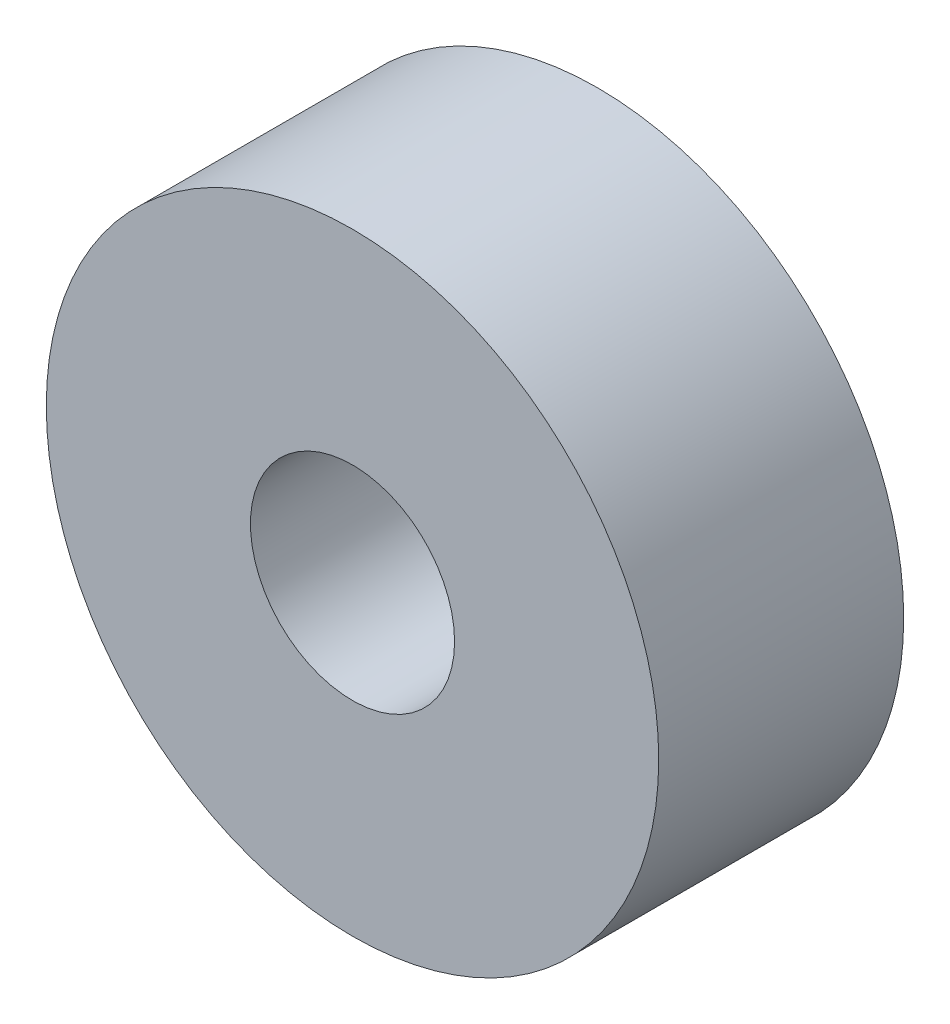
ISO-10303-21;
HEADER;
FILE_DESCRIPTION(('STEP AP214'),'2;1');
FILE_NAME('part.step','',(''),(''),'','','');
FILE_SCHEMA(('AUTOMOTIVE_DESIGN { 1 0 10303 214 1 1 1 1 }'));
ENDSEC;
DATA;
#1=APPLICATION_CONTEXT('core data for automotive mechanical design processes');
#2=APPLICATION_PROTOCOL_DEFINITION('international standard','automotive_design',2000,#1);
#3=PRODUCT_CONTEXT('',#1,'mechanical');
#4=PRODUCT('Part','Part','',(#3));
#5=PRODUCT_RELATED_PRODUCT_CATEGORY('part','',(#4));
#6=PRODUCT_DEFINITION_FORMATION('','',#4);
#7=PRODUCT_DEFINITION_CONTEXT('part definition',#1,'design');
#8=PRODUCT_DEFINITION('design','',#6,#7);
#9=PRODUCT_DEFINITION_SHAPE('','',#8);
#10=(LENGTH_UNIT() NAMED_UNIT(*) SI_UNIT(.MILLI.,.METRE.));
#11=(NAMED_UNIT(*) PLANE_ANGLE_UNIT() SI_UNIT($,.RADIAN.));
#12=(NAMED_UNIT(*) SI_UNIT($,.STERADIAN.) SOLID_ANGLE_UNIT());
#13=UNCERTAINTY_MEASURE_WITH_UNIT(LENGTH_MEASURE(1.E-05),#10,'distance_accuracy_value','');
#14=(GEOMETRIC_REPRESENTATION_CONTEXT(3) GLOBAL_UNCERTAINTY_ASSIGNED_CONTEXT((#13)) GLOBAL_UNIT_ASSIGNED_CONTEXT((#10,
#11,#12)) REPRESENTATION_CONTEXT('',''));
#15=CARTESIAN_POINT('',(0.,0.,0.));
#16=DIRECTION('',(0.,0.,1.));
#17=DIRECTION('',(1.,0.,0.));
#18=AXIS2_PLACEMENT_3D('',#15,#16,#17);
#19=CARTESIAN_POINT('',(0.,0.,6.));
#20=DIRECTION('',(0.,0.,1.));
#21=DIRECTION('',(1.,0.,0.));
#22=AXIS2_PLACEMENT_3D('',#19,#20,#21);
#23=PLANE('',#22);
#24=CARTESIAN_POINT('',(0.,0.,6.));
#25=DIRECTION('',(0.,0.,1.));
#26=DIRECTION('',(1.,0.,0.));
#27=AXIS2_PLACEMENT_3D('',#24,#25,#26);
#28=CIRCLE('',#27,7.5);
#29=CARTESIAN_POINT('',(7.5,0.,6.));
#30=VERTEX_POINT('',#29);
#31=EDGE_CURVE('E10',#30,#30,#28,.T.);
#32=ORIENTED_EDGE('',*,*,#31,.T.);
#33=EDGE_LOOP('',(#32));
#34=FACE_BOUND('',#33,.T.);
#35=CARTESIAN_POINT('',(0.,0.,6.));
#36=DIRECTION('',(0.,0.,1.));
#37=DIRECTION('',(1.,0.,0.));
#38=AXIS2_PLACEMENT_3D('',#35,#36,#37);
#39=CIRCLE('',#38,2.5);
#40=CARTESIAN_POINT('',(2.5,0.,6.));
#41=VERTEX_POINT('',#40);
#42=EDGE_CURVE('E56',#41,#41,#39,.T.);
#43=ORIENTED_EDGE('',*,*,#42,.F.);
#44=EDGE_LOOP('',(#43));
#45=FACE_BOUND('',#44,.T.);
#46=ADVANCED_FACE('F43',(#34,#45),#23,.T.);
#47=CARTESIAN_POINT('',(0.,0.,0.));
#48=DIRECTION('',(0.,0.,1.));
#49=DIRECTION('',(1.,0.,0.));
#50=AXIS2_PLACEMENT_3D('',#47,#48,#49);
#51=PLANE('',#50);
#52=CARTESIAN_POINT('',(0.,0.,0.));
#53=DIRECTION('',(0.,0.,1.));
#54=DIRECTION('',(1.,0.,0.));
#55=AXIS2_PLACEMENT_3D('',#52,#53,#54);
#56=CIRCLE('',#55,7.5);
#57=CARTESIAN_POINT('',(7.5,0.,0.));
#58=VERTEX_POINT('',#57);
#59=EDGE_CURVE('E47',#58,#58,#56,.T.);
#60=ORIENTED_EDGE('',*,*,#59,.F.);
#61=EDGE_LOOP('',(#60));
#62=FACE_BOUND('',#61,.T.);
#63=CARTESIAN_POINT('',(0.,0.,0.));
#64=DIRECTION('',(0.,0.,1.));
#65=DIRECTION('',(1.,0.,0.));
#66=AXIS2_PLACEMENT_3D('',#63,#64,#65);
#67=CIRCLE('',#66,2.5);
#68=CARTESIAN_POINT('',(2.5,0.,0.));
#69=VERTEX_POINT('',#68);
#70=EDGE_CURVE('E58',#69,#69,#67,.T.);
#71=ORIENTED_EDGE('',*,*,#70,.T.);
#72=EDGE_LOOP('',(#71));
#73=FACE_BOUND('',#72,.T.);
#74=ADVANCED_FACE('F70',(#62,#73),#51,.F.);
#75=CARTESIAN_POINT('',(0.,0.,6.));
#76=DIRECTION('',(0.,0.,-1.));
#77=DIRECTION('',(-1.,0.,0.));
#78=AXIS2_PLACEMENT_3D('',#75,#76,#77);
#79=CYLINDRICAL_SURFACE('',#78,7.5);
#80=ORIENTED_EDGE('',*,*,#31,.F.);
#81=EDGE_LOOP('',(#80));
#82=FACE_BOUND('',#81,.T.);
#83=ORIENTED_EDGE('',*,*,#59,.T.);
#84=EDGE_LOOP('',(#83));
#85=FACE_BOUND('',#84,.T.);
#86=ADVANCED_FACE('F45',(#82,#85),#79,.T.);
#87=CARTESIAN_POINT('',(0.,0.,6.));
#88=DIRECTION('',(0.,0.,-1.));
#89=DIRECTION('',(-1.,0.,0.));
#90=AXIS2_PLACEMENT_3D('',#87,#88,#89);
#91=CYLINDRICAL_SURFACE('',#90,2.5);
#92=ORIENTED_EDGE('',*,*,#42,.T.);
#93=EDGE_LOOP('',(#92));
#94=FACE_BOUND('',#93,.T.);
#95=ORIENTED_EDGE('',*,*,#70,.F.);
#96=EDGE_LOOP('',(#95));
#97=FACE_BOUND('',#96,.T.);
#98=ADVANCED_FACE('F66',(#94,#97),#91,.F.);
#99=CLOSED_SHELL('',(#46,#74,#86,#98));
#100=MANIFOLD_SOLID_BREP('B2',#99);
#101=ADVANCED_BREP_SHAPE_REPRESENTATION('',(#18,#100),#14);
#102=SHAPE_DEFINITION_REPRESENTATION(#9,#101);
ENDSEC;
END-ISO-10303-21;
